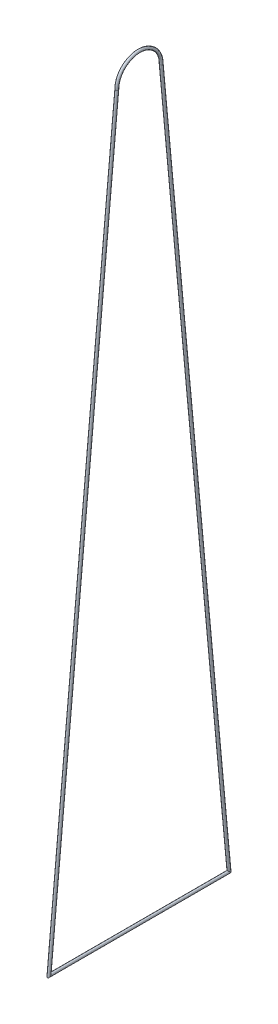
ISO-10303-21;
HEADER;
FILE_DESCRIPTION(('STEP AP214'),'2;1');
FILE_NAME('part.step','',(''),(''),'','','');
FILE_SCHEMA(('AUTOMOTIVE_DESIGN { 1 0 10303 214 1 1 1 1 }'));
ENDSEC;
DATA;
#1=APPLICATION_CONTEXT('core data for automotive mechanical design processes');
#2=APPLICATION_PROTOCOL_DEFINITION('international standard','automotive_design',2000,#1);
#3=PRODUCT_CONTEXT('',#1,'mechanical');
#4=PRODUCT('Part','Part','',(#3));
#5=PRODUCT_RELATED_PRODUCT_CATEGORY('part','',(#4));
#6=PRODUCT_DEFINITION_FORMATION('','',#4);
#7=PRODUCT_DEFINITION_CONTEXT('part definition',#1,'design');
#8=PRODUCT_DEFINITION('design','',#6,#7);
#9=PRODUCT_DEFINITION_SHAPE('','',#8);
#10=(LENGTH_UNIT() NAMED_UNIT(*) SI_UNIT(.MILLI.,.METRE.));
#11=(NAMED_UNIT(*) PLANE_ANGLE_UNIT() SI_UNIT($,.RADIAN.));
#12=(NAMED_UNIT(*) SI_UNIT($,.STERADIAN.) SOLID_ANGLE_UNIT());
#13=UNCERTAINTY_MEASURE_WITH_UNIT(LENGTH_MEASURE(1.E-05),#10,'distance_accuracy_value','');
#14=(GEOMETRIC_REPRESENTATION_CONTEXT(3) GLOBAL_UNCERTAINTY_ASSIGNED_CONTEXT((#13)) GLOBAL_UNIT_ASSIGNED_CONTEXT((#10,
#11,#12)) REPRESENTATION_CONTEXT('',''));
#15=CARTESIAN_POINT('',(0.,0.,0.));
#16=DIRECTION('',(0.,0.,1.));
#17=DIRECTION('',(1.,0.,0.));
#18=AXIS2_PLACEMENT_3D('',#15,#16,#17);
#19=CARTESIAN_POINT('',(-108.,75.4276616612493,-1.7));
#20=CARTESIAN_POINT('',(-108.,22.4525712158631,-6.59836475197597));
#21=CARTESIAN_POINT('',(-107.8,75.4276616612493,-1.7));
#22=CARTESIAN_POINT('',(-107.8,22.4525712158631,-6.59836475197597));
#23=CARTESIAN_POINT('',(-107.8,75.4184347979198,-1.50000000000001));
#24=CARTESIAN_POINT('',(-107.8,22.652571215863,-6.37901849916393));
#25=CARTESIAN_POINT('',(-108.,75.4184347979198,-1.50000000000001));
#26=CARTESIAN_POINT('',(-108.,22.652571215863,-6.37901849916393));
#27=CARTESIAN_POINT('',(-108.2,75.4184347979198,-1.50000000000001));
#28=CARTESIAN_POINT('',(-108.2,22.652571215863,-6.37901849916393));
#29=CARTESIAN_POINT('',(-108.2,75.4276616612493,-1.7));
#30=CARTESIAN_POINT('',(-108.2,22.4525712158631,-6.59836475197597));
#31=CARTESIAN_POINT('',(-108.,75.4276616612493,-1.7));
#32=CARTESIAN_POINT('',(-108.,22.4525712158631,-6.59836475197597));
#33=(BOUNDED_SURFACE() B_SPLINE_SURFACE(3,1,((#19,#20),(#21,#22),(#23,#24),(#25,#26),(#27,#28),
(#29,#30),(#31,#32)),.UNSPECIFIED.,.T.,.F.,.F.) B_SPLINE_SURFACE_WITH_KNOTS((4,3,4),(2,2),(0.,
0.5,1.),(0.,1.),.UNSPECIFIED.) GEOMETRIC_REPRESENTATION_ITEM() RATIONAL_B_SPLINE_SURFACE(((1.,
1.),(0.333333333333333,0.333333333333333),(0.333333333333333,0.333333333333333),(1.,1.),
(0.333333333333333,0.333333333333333),(0.333333333333333,0.333333333333333),(1.,1.))) REPRESENTATION_ITEM('') SURFACE());
#34=CARTESIAN_POINT('',(-108.,75.4276616612493,-1.69999999999997));
#35=CARTESIAN_POINT('',(-108.2,75.4276616612493,-1.70000000000017));
#36=CARTESIAN_POINT('',(-108.2,75.4184347979198,-1.50000000000022));
#37=CARTESIAN_POINT('',(-108.,75.4184347979198,-1.50000000000002));
#38=CARTESIAN_POINT('',(-107.8,75.4184347979198,-1.49999999999981));
#39=CARTESIAN_POINT('',(-107.8,75.4276616612493,-1.69999999999977));
#40=CARTESIAN_POINT('',(-108.,75.4276616612493,-1.69999999999997));
#41=(BOUNDED_CURVE() B_SPLINE_CURVE(3,(#34,#35,#36,#37,#38,#39,#40),.UNSPECIFIED.,.T.,
.F.) B_SPLINE_CURVE_WITH_KNOTS((4,3,4),(0.,0.5,1.),
.UNSPECIFIED.) CURVE() GEOMETRIC_REPRESENTATION_ITEM() RATIONAL_B_SPLINE_CURVE((1.,
0.333333333333333,0.333333333333333,1.,0.333333333333333,0.333333333333333,1.)) REPRESENTATION_ITEM(''));
#42=CARTESIAN_POINT('',(-108.,75.4276616612493,-1.69999999999997));
#43=VERTEX_POINT('',#42);
#44=EDGE_CURVE('E49',#43,#43,#41,.F.);
#45=CARTESIAN_POINT('',(-108.,22.4525712158631,-6.59836475197598));
#46=CARTESIAN_POINT('',(-108.2,22.4525712158631,-6.59836475197598));
#47=CARTESIAN_POINT('',(-108.2,22.652571215863,-6.37901849916393));
#48=CARTESIAN_POINT('',(-108.,22.652571215863,-6.37901849916393));
#49=CARTESIAN_POINT('',(-107.8,22.652571215863,-6.37901849916393));
#50=CARTESIAN_POINT('',(-107.8,22.4525712158631,-6.59836475197598));
#51=CARTESIAN_POINT('',(-108.,22.4525712158631,-6.59836475197598));
#52=(BOUNDED_CURVE() B_SPLINE_CURVE(3,(#45,#46,#47,#48,#49,#50,#51),.UNSPECIFIED.,.T.,
.F.) B_SPLINE_CURVE_WITH_KNOTS((4,3,4),(0.,0.5,1.),
.UNSPECIFIED.) CURVE() GEOMETRIC_REPRESENTATION_ITEM() RATIONAL_B_SPLINE_CURVE((1.,
0.333333333333333,0.333333333333333,1.,0.333333333333333,0.333333333333333,1.)) REPRESENTATION_ITEM(''));
#53=CARTESIAN_POINT('',(-108.,22.4525712158631,-6.59836475197598));
#54=VERTEX_POINT('',#53);
#55=EDGE_CURVE('E45',#54,#54,#52,.T.);
#56=ORIENTED_EDGE('',*,*,#44,.T.);
#57=EDGE_LOOP('',(#56));
#58=FACE_BOUND('',#57,.T.);
#59=ORIENTED_EDGE('',*,*,#55,.T.);
#60=EDGE_LOOP('',(#59));
#61=FACE_BOUND('',#60,.T.);
#62=ADVANCED_FACE('F35',(#58,#61),#33,.T.);
#63=CARTESIAN_POINT('',(-108.,22.4525712158631,-6.59836475197598));
#64=CARTESIAN_POINT('',(-108.,22.4525712158631,6.59836475197578));
#65=CARTESIAN_POINT('',(-108.2,22.4525712158631,-6.59836475197598));
#66=CARTESIAN_POINT('',(-108.2,22.4525712158631,6.59836475197578));
#67=CARTESIAN_POINT('',(-108.2,22.652571215863,-6.37901849916393));
#68=CARTESIAN_POINT('',(-108.2,22.652571215863,6.37901849916374));
#69=CARTESIAN_POINT('',(-108.,22.652571215863,-6.37901849916393));
#70=CARTESIAN_POINT('',(-108.,22.652571215863,6.37901849916374));
#71=CARTESIAN_POINT('',(-107.8,22.652571215863,-6.37901849916393));
#72=CARTESIAN_POINT('',(-107.8,22.652571215863,6.37901849916374));
#73=CARTESIAN_POINT('',(-107.8,22.4525712158631,-6.59836475197598));
#74=CARTESIAN_POINT('',(-107.8,22.4525712158631,6.59836475197578));
#75=CARTESIAN_POINT('',(-108.,22.4525712158631,-6.59836475197598));
#76=CARTESIAN_POINT('',(-108.,22.4525712158631,6.59836475197578));
#77=(BOUNDED_SURFACE() B_SPLINE_SURFACE(3,1,((#63,#64),(#65,#66),(#67,#68),(#69,#70),(#71,#72),
(#73,#74),(#75,#76)),.UNSPECIFIED.,.T.,.F.,.F.) B_SPLINE_SURFACE_WITH_KNOTS((4,3,4),(2,2),(0.,
0.5,1.),(0.,1.),.UNSPECIFIED.) GEOMETRIC_REPRESENTATION_ITEM() RATIONAL_B_SPLINE_SURFACE(((1.,
1.),(0.333333333333333,0.333333333333333),(0.333333333333333,0.333333333333333),(1.,1.),
(0.333333333333333,0.333333333333333),(0.333333333333333,0.333333333333333),(1.,1.))) REPRESENTATION_ITEM('') SURFACE());
#78=CARTESIAN_POINT('',(-108.,22.4525712158631,6.59836475197578));
#79=CARTESIAN_POINT('',(-108.2,22.4525712158631,6.59836475197578));
#80=CARTESIAN_POINT('',(-108.2,22.652571215863,6.37901849916374));
#81=CARTESIAN_POINT('',(-108.,22.652571215863,6.37901849916374));
#82=CARTESIAN_POINT('',(-107.8,22.652571215863,6.37901849916374));
#83=CARTESIAN_POINT('',(-107.8,22.4525712158631,6.59836475197578));
#84=CARTESIAN_POINT('',(-108.,22.4525712158631,6.59836475197578));
#85=(BOUNDED_CURVE() B_SPLINE_CURVE(3,(#78,#79,#80,#81,#82,#83,#84),.UNSPECIFIED.,.T.,
.F.) B_SPLINE_CURVE_WITH_KNOTS((4,3,4),(0.,0.5,1.),
.UNSPECIFIED.) CURVE() GEOMETRIC_REPRESENTATION_ITEM() RATIONAL_B_SPLINE_CURVE((1.,
0.333333333333333,0.333333333333333,1.,0.333333333333333,0.333333333333333,1.)) REPRESENTATION_ITEM(''));
#86=CARTESIAN_POINT('',(-108.,22.4525712158631,6.59836475197578));
#87=VERTEX_POINT('',#86);
#88=EDGE_CURVE('E11',#87,#87,#85,.F.);
#89=ORIENTED_EDGE('',*,*,#55,.F.);
#90=EDGE_LOOP('',(#89));
#91=FACE_BOUND('',#90,.T.);
#92=ORIENTED_EDGE('',*,*,#88,.F.);
#93=EDGE_LOOP('',(#92));
#94=FACE_BOUND('',#93,.T.);
#95=ADVANCED_FACE('F83',(#91,#94),#77,.F.);
#96=CARTESIAN_POINT('',(-108.,22.4525712158631,6.59836475197578));
#97=CARTESIAN_POINT('',(-108.,75.4276616612493,1.69999999999999));
#98=CARTESIAN_POINT('',(-107.8,22.4525712158631,6.59836475197578));
#99=CARTESIAN_POINT('',(-107.8,75.4276616612493,1.69999999999999));
#100=CARTESIAN_POINT('',(-107.8,22.652571215863,6.37901849916374));
#101=CARTESIAN_POINT('',(-107.8,75.4184347979198,1.50000000000003));
#102=CARTESIAN_POINT('',(-108.,22.652571215863,6.37901849916374));
#103=CARTESIAN_POINT('',(-108.,75.4184347979198,1.50000000000003));
#104=CARTESIAN_POINT('',(-108.2,22.652571215863,6.37901849916374));
#105=CARTESIAN_POINT('',(-108.2,75.4184347979198,1.50000000000003));
#106=CARTESIAN_POINT('',(-108.2,22.4525712158631,6.59836475197578));
#107=CARTESIAN_POINT('',(-108.2,75.4276616612493,1.69999999999999));
#108=CARTESIAN_POINT('',(-108.,22.4525712158631,6.59836475197578));
#109=CARTESIAN_POINT('',(-108.,75.4276616612493,1.69999999999999));
#110=(BOUNDED_SURFACE() B_SPLINE_SURFACE(3,1,((#96,#97),(#98,#99),(#100,#101),(#102,#103),(#104,
#105),(#106,#107),(#108,#109)),.UNSPECIFIED.,.T.,.F.,.F.) B_SPLINE_SURFACE_WITH_KNOTS((4,3,4),
(2,2),(0.,0.5,1.),(0.,1.),
.UNSPECIFIED.) GEOMETRIC_REPRESENTATION_ITEM() RATIONAL_B_SPLINE_SURFACE(((1.,1.),
(0.333333333333333,0.333333333333333),(0.333333333333333,0.333333333333333),(1.,1.),
(0.333333333333333,0.333333333333333),(0.333333333333333,0.333333333333333),(1.,1.))) REPRESENTATION_ITEM('') SURFACE());
#111=CARTESIAN_POINT('',(-108.,75.4276616612493,1.69999999999999));
#112=CARTESIAN_POINT('',(-108.2,75.4276616612493,1.69999999999999));
#113=CARTESIAN_POINT('',(-108.2,75.4184347979198,1.50000000000003));
#114=CARTESIAN_POINT('',(-108.,75.4184347979198,1.50000000000003));
#115=CARTESIAN_POINT('',(-107.8,75.4184347979198,1.50000000000003));
#116=CARTESIAN_POINT('',(-107.8,75.4276616612493,1.69999999999999));
#117=CARTESIAN_POINT('',(-108.,75.4276616612493,1.69999999999999));
#118=(BOUNDED_CURVE() B_SPLINE_CURVE(3,(#111,#112,#113,#114,#115,#116,#117),.UNSPECIFIED.,.T.,
.F.) B_SPLINE_CURVE_WITH_KNOTS((4,3,4),(0.,0.5,1.),
.UNSPECIFIED.) CURVE() GEOMETRIC_REPRESENTATION_ITEM() RATIONAL_B_SPLINE_CURVE((1.,
0.333333333333333,0.333333333333333,1.,0.333333333333333,0.333333333333333,1.)) REPRESENTATION_ITEM(''));
#119=CARTESIAN_POINT('',(-108.,75.4276616612493,1.69999999999999));
#120=VERTEX_POINT('',#119);
#121=EDGE_CURVE('E53',#120,#120,#118,.T.);
#122=ORIENTED_EDGE('',*,*,#88,.T.);
#123=EDGE_LOOP('',(#122));
#124=FACE_BOUND('',#123,.T.);
#125=ORIENTED_EDGE('',*,*,#121,.T.);
#126=EDGE_LOOP('',(#125));
#127=FACE_BOUND('',#126,.T.);
#128=ADVANCED_FACE('F74',(#124,#127),#110,.T.);
#129=CARTESIAN_POINT('',(-108.,75.4276616612493,1.69999999999999));
#130=CARTESIAN_POINT('',(-108.,75.4993138640121,1.69999999999999));
#131=CARTESIAN_POINT('',(-108.,75.6613754404232,1.68948330947862));
#132=CARTESIAN_POINT('',(-108.,75.9144334313596,1.63659191961719));
#133=CARTESIAN_POINT('',(-108.,76.1849466575564,1.53062088945838));
#134=CARTESIAN_POINT('',(-108.,76.4388487757896,1.37538067679284));
#135=CARTESIAN_POINT('',(-108.,76.6659746401382,1.16775701586396));
#136=CARTESIAN_POINT('',(-108.,76.8494470950689,0.927414718208074));
#137=CARTESIAN_POINT('',(-108.,76.9981064486479,0.647301798090564));
#138=CARTESIAN_POINT('',(-108.,77.0982731866027,0.334644791745958));
#139=CARTESIAN_POINT('',(-108.,77.1355772023252,1.9491070830049E-13));
#140=CARTESIAN_POINT('',(-108.,77.0982731866028,-0.334644791745968));
#141=CARTESIAN_POINT('',(-108.,76.9981064486479,-0.647301798090489));
#142=CARTESIAN_POINT('',(-108.,76.8494470950689,-0.927414718208006));
#143=CARTESIAN_POINT('',(-108.,76.6659746401381,-1.16775701586391));
#144=CARTESIAN_POINT('',(-108.,76.4388487757896,-1.3753806767928));
#145=CARTESIAN_POINT('',(-108.,76.1849466575564,-1.53062088945832));
#146=CARTESIAN_POINT('',(-108.,75.9144334313597,-1.63659191961717));
#147=CARTESIAN_POINT('',(-108.,75.6613754404233,-1.6894833094786));
#148=CARTESIAN_POINT('',(-108.,75.4993138640121,-1.69999999999997));
#149=CARTESIAN_POINT('',(-108.,75.4276616612493,-1.69999999999997));
#150=CARTESIAN_POINT('',(-108.2,75.4276616612493,1.69999999999999));
#151=CARTESIAN_POINT('',(-108.2,75.4908157342254,1.69999999999999));
#152=CARTESIAN_POINT('',(-108.2,75.6658484158912,1.68948330947862));
#153=CARTESIAN_POINT('',(-108.2,75.9130191122021,1.63659191961722));
#154=CARTESIAN_POINT('',(-108.2,76.1853951416286,1.53062088945833));
#155=CARTESIAN_POINT('',(-108.2,76.4387387902742,1.37538067679287));
#156=CARTESIAN_POINT('',(-108.2,76.6660048286344,1.16775701586397));
#157=CARTESIAN_POINT('',(-108.2,76.8494383570342,0.927414718208125));
#158=CARTESIAN_POINT('',(-108.2,76.9981089180327,0.647301798090545));
#159=CARTESIAN_POINT('',(-108.2,77.098272455041,0.334644791745982));
#160=CARTESIAN_POINT('',(-108.2,77.1355775722829,2.03525455693704E-13));
#161=CARTESIAN_POINT('',(-108.2,77.098272455041,-0.334644791745984));
#162=CARTESIAN_POINT('',(-108.2,76.9981089180327,-0.647301798090494));
#163=CARTESIAN_POINT('',(-108.2,76.8494383570341,-0.927414718207991));
#164=CARTESIAN_POINT('',(-108.2,76.6660048286345,-1.16775701586396));
#165=CARTESIAN_POINT('',(-108.2,76.4387387902741,-1.37538067679274));
#166=CARTESIAN_POINT('',(-108.2,76.1853951416287,-1.53062088945826));
#167=CARTESIAN_POINT('',(-108.2,75.9130191122021,-1.63659191961728));
#168=CARTESIAN_POINT('',(-108.2,75.6658484158913,-1.68948330947879));
#169=CARTESIAN_POINT('',(-108.2,75.4908157342254,-1.70000000000017));
#170=CARTESIAN_POINT('',(-108.2,75.4276616612493,-1.70000000000017));
#171=CARTESIAN_POINT('',(-108.2,75.4184347979198,1.50000000000003));
#172=CARTESIAN_POINT('',(-108.2,75.4815888708959,1.50000000000003));
#173=CARTESIAN_POINT('',(-108.2,75.6389242897183,1.49068825280341));
#174=CARTESIAN_POINT('',(-108.2,75.8555846177867,1.44395952883755));
#175=CARTESIAN_POINT('',(-108.2,76.0945872084601,1.35137567098825));
#176=CARTESIAN_POINT('',(-108.2,76.3205601479912,1.21246252545794));
#177=CARTESIAN_POINT('',(-108.2,76.515997751918,1.03365385121697));
#178=CARTESIAN_POINT('',(-108.2,76.6804928250417,0.818894644849165));
#179=CARTESIAN_POINT('',(-108.2,76.8128811383162,0.569072737598581));
#180=CARTESIAN_POINT('',(-108.2,76.9015444648334,0.291812418257757));
#181=CARTESIAN_POINT('',(-108.2,76.9339228860922,-1.5926084052109E-13));
#182=CARTESIAN_POINT('',(-108.2,76.9015444648334,-0.291812418257556));
#183=CARTESIAN_POINT('',(-108.2,76.8128811383162,-0.569072737598572));
#184=CARTESIAN_POINT('',(-108.2,76.6804928250415,-0.818894644849003));
#185=CARTESIAN_POINT('',(-108.2,76.5159977519181,-1.03365385121698));
#186=CARTESIAN_POINT('',(-108.2,76.3205601479911,-1.21246252545778));
#187=CARTESIAN_POINT('',(-108.2,76.0945872084602,-1.35137567098819));
#188=CARTESIAN_POINT('',(-108.2,75.8555846177867,-1.44395952883761));
#189=CARTESIAN_POINT('',(-108.2,75.6389242897184,-1.49068825280357));
#190=CARTESIAN_POINT('',(-108.2,75.481588870896,-1.50000000000022));
#191=CARTESIAN_POINT('',(-108.2,75.4184347979198,-1.50000000000022));
#192=CARTESIAN_POINT('',(-108.,75.4184347979198,1.50000000000003));
#193=CARTESIAN_POINT('',(-108.,75.4858379357893,1.50000000000003));
#194=CARTESIAN_POINT('',(-108.,75.6366878019844,1.49068825280341));
#195=CARTESIAN_POINT('',(-108.,75.8562917773654,1.44395952883752));
#196=CARTESIAN_POINT('',(-108.,76.094362966424,1.35137567098831));
#197=CARTESIAN_POINT('',(-108.,76.3206151407489,1.2124625254579));
#198=CARTESIAN_POINT('',(-108.,76.5159826576699,1.03365385121697));
#199=CARTESIAN_POINT('',(-108.,76.680497194059,0.81889464484913));
#200=CARTESIAN_POINT('',(-108.,76.8128799036238,0.56907273759858));
#201=CARTESIAN_POINT('',(-108.,76.9015448306143,0.291812418257732));
#202=CARTESIAN_POINT('',(-108.,76.9339227011134,-1.64264714086203E-13));
#203=CARTESIAN_POINT('',(-108.,76.9015448306143,-0.291812418257553));
#204=CARTESIAN_POINT('',(-108.,76.8128799036238,-0.569072737598559));
#205=CARTESIAN_POINT('',(-108.,76.6804971940589,-0.818894644849033));
#206=CARTESIAN_POINT('',(-108.,76.5159826576699,-1.03365385121694));
#207=CARTESIAN_POINT('',(-108.,76.3206151407489,-1.21246252545784));
#208=CARTESIAN_POINT('',(-108.,76.094362966424,-1.35137567098826));
#209=CARTESIAN_POINT('',(-108.,75.8562917773655,-1.44395952883749));
#210=CARTESIAN_POINT('',(-108.,75.6366878019844,-1.49068825280339));
#211=CARTESIAN_POINT('',(-108.,75.4858379357893,-1.50000000000002));
#212=CARTESIAN_POINT('',(-108.,75.4184347979198,-1.50000000000002));
#213=CARTESIAN_POINT('',(-107.8,75.4184347979198,1.50000000000003));
#214=CARTESIAN_POINT('',(-107.8,75.4900870006826,1.50000000000003));
#215=CARTESIAN_POINT('',(-107.8,75.6344513142504,1.49068825280341));
#216=CARTESIAN_POINT('',(-107.8,75.8569989369442,1.4439595288375));
#217=CARTESIAN_POINT('',(-107.8,76.0941387243879,1.35137567098833));
#218=CARTESIAN_POINT('',(-107.8,76.3206701335066,1.21246252545788));
#219=CARTESIAN_POINT('',(-107.8,76.5159675634219,1.033653851217));
#220=CARTESIAN_POINT('',(-107.8,76.6805015630763,0.818894644849061));
#221=CARTESIAN_POINT('',(-107.8,76.8128786689314,0.569072737598597));
#222=CARTESIAN_POINT('',(-107.8,76.9015451963951,0.29181241825774));
#223=CARTESIAN_POINT('',(-107.8,76.9339225161346,-1.68044932980372E-13));
#224=CARTESIAN_POINT('',(-107.8,76.9015451963951,-0.291812418257566));
#225=CARTESIAN_POINT('',(-107.8,76.8128786689314,-0.569072737598526));
#226=CARTESIAN_POINT('',(-107.8,76.6805015630764,-0.818894644849107));
#227=CARTESIAN_POINT('',(-107.8,76.5159675634217,-1.03365385121687));
#228=CARTESIAN_POINT('',(-107.8,76.3206701335067,-1.21246252545789));
#229=CARTESIAN_POINT('',(-107.8,76.0941387243879,-1.35137567098831));
#230=CARTESIAN_POINT('',(-107.8,75.8569989369442,-1.44395952883738));
#231=CARTESIAN_POINT('',(-107.8,75.6344513142504,-1.4906882528032));
#232=CARTESIAN_POINT('',(-107.8,75.4900870006826,-1.49999999999981));
#233=CARTESIAN_POINT('',(-107.8,75.4184347979198,-1.49999999999981));
#234=CARTESIAN_POINT('',(-107.8,75.4276616612493,1.69999999999999));
#235=CARTESIAN_POINT('',(-107.8,75.5078119937988,1.69999999999999));
#236=CARTESIAN_POINT('',(-107.8,75.6569024649553,1.68948330947862));
#237=CARTESIAN_POINT('',(-107.8,75.9158477505171,1.63659191961716));
#238=CARTESIAN_POINT('',(-107.8,76.1844981734841,1.53062088945841));
#239=CARTESIAN_POINT('',(-107.8,76.438958761305,1.3753806767928));
#240=CARTESIAN_POINT('',(-107.8,76.6659444516419,1.16775701586399));
#241=CARTESIAN_POINT('',(-107.8,76.8494558331036,0.92741471820802));
#242=CARTESIAN_POINT('',(-107.8,76.9981039792631,0.647301798090561));
#243=CARTESIAN_POINT('',(-107.8,77.0982739181644,0.334644791745964));
#244=CARTESIAN_POINT('',(-107.8,77.1355768323676,1.94741363234422E-13));
#245=CARTESIAN_POINT('',(-107.8,77.0982739181644,-0.334644791745994));
#246=CARTESIAN_POINT('',(-107.8,76.998103979263,-0.647301798090449));
#247=CARTESIAN_POINT('',(-107.8,76.8494558331037,-0.927414718208095));
#248=CARTESIAN_POINT('',(-107.8,76.6659444516418,-1.16775701586385));
#249=CARTESIAN_POINT('',(-107.8,76.4389587613051,-1.37538067679285));
#250=CARTESIAN_POINT('',(-107.8,76.1844981734841,-1.53062088945838));
#251=CARTESIAN_POINT('',(-107.8,75.9158477505172,-1.63659191961704));
#252=CARTESIAN_POINT('',(-107.8,75.6569024649553,-1.68948330947841));
#253=CARTESIAN_POINT('',(-107.8,75.5078119937988,-1.69999999999977));
#254=CARTESIAN_POINT('',(-107.8,75.4276616612493,-1.69999999999977));
#255=CARTESIAN_POINT('',(-108.,75.4276616612493,1.69999999999999));
#256=CARTESIAN_POINT('',(-108.,75.4993138640121,1.69999999999999));
#257=CARTESIAN_POINT('',(-108.,75.6613754404232,1.68948330947862));
#258=CARTESIAN_POINT('',(-108.,75.9144334313596,1.63659191961719));
#259=CARTESIAN_POINT('',(-108.,76.1849466575564,1.53062088945838));
#260=CARTESIAN_POINT('',(-108.,76.4388487757896,1.37538067679284));
#261=CARTESIAN_POINT('',(-108.,76.6659746401382,1.16775701586396));
#262=CARTESIAN_POINT('',(-108.,76.8494470950689,0.927414718208074));
#263=CARTESIAN_POINT('',(-108.,76.9981064486479,0.647301798090564));
#264=CARTESIAN_POINT('',(-108.,77.0982731866027,0.334644791745958));
#265=CARTESIAN_POINT('',(-108.,77.1355772023252,1.9491070830049E-13));
#266=CARTESIAN_POINT('',(-108.,77.0982731866028,-0.334644791745968));
#267=CARTESIAN_POINT('',(-108.,76.9981064486479,-0.647301798090489));
#268=CARTESIAN_POINT('',(-108.,76.8494470950689,-0.927414718208006));
#269=CARTESIAN_POINT('',(-108.,76.6659746401381,-1.16775701586391));
#270=CARTESIAN_POINT('',(-108.,76.4388487757896,-1.3753806767928));
#271=CARTESIAN_POINT('',(-108.,76.1849466575564,-1.53062088945832));
#272=CARTESIAN_POINT('',(-108.,75.9144334313597,-1.63659191961717));
#273=CARTESIAN_POINT('',(-108.,75.6613754404233,-1.6894833094786));
#274=CARTESIAN_POINT('',(-108.,75.4993138640121,-1.69999999999997));
#275=CARTESIAN_POINT('',(-108.,75.4276616612493,-1.69999999999997));
#276=(BOUNDED_SURFACE() B_SPLINE_SURFACE(3,3,((#129,#130,#131,#132,#133,#134,#135,#136,#137,
#138,#139,#140,#141,#142,#143,#144,#145,#146,#147,#148,#149),(#150,#151,#152,#153,#154,#155,
#156,#157,#158,#159,#160,#161,#162,#163,#164,#165,#166,#167,#168,#169,#170),(#171,#172,#173,
#174,#175,#176,#177,#178,#179,#180,#181,#182,#183,#184,#185,#186,#187,#188,#189,#190,#191),
(#192,#193,#194,#195,#196,#197,#198,#199,#200,#201,#202,#203,#204,#205,#206,#207,#208,#209,#210,
#211,#212),(#213,#214,#215,#216,#217,#218,#219,#220,#221,#222,#223,#224,#225,#226,#227,#228,
#229,#230,#231,#232,#233),(#234,#235,#236,#237,#238,#239,#240,#241,#242,#243,#244,#245,#246,
#247,#248,#249,#250,#251,#252,#253,#254),(#255,#256,#257,#258,#259,#260,#261,#262,#263,#264,
#265,#266,#267,#268,#269,#270,#271,#272,#273,#274,#275)),.UNSPECIFIED.,.T.,.F.,
.F.) B_SPLINE_SURFACE_WITH_KNOTS((4,3,4),(4,1,1,1,1,1,1,1,1,1,1,1,1,1,1,1,1,1,4),(0.,0.5,1.),
(0.,0.0427466368514522,0.0911740627971556,0.145038452560422,0.205133484196707,0.258545158375598,
0.315767193965245,0.375584775953485,0.437082048586603,0.499999999999993,0.562917951413389,
0.624415224046512,0.684232806034754,0.741454841624401,0.794866515803287,0.854961547439565,
0.908825937202832,0.957253363148537,1.),
.UNSPECIFIED.) GEOMETRIC_REPRESENTATION_ITEM() RATIONAL_B_SPLINE_SURFACE(((1.,1.,1.,1.,1.,1.,1.,
1.,1.,1.,1.,1.,1.,1.,1.,1.,1.,1.,1.,1.,1.),(0.333333333333333,0.333333333333333,
0.333333333333333,0.333333333333333,0.333333333333333,0.333333333333333,0.333333333333333,
0.333333333333333,0.333333333333333,0.333333333333333,0.333333333333333,0.333333333333333,
0.333333333333333,0.333333333333333,0.333333333333333,0.333333333333333,0.333333333333334,
0.333333333333333,0.333333333333333,0.333333333333333,0.333333333333333),(0.333333333333333,
0.333333333333333,0.333333333333333,0.333333333333333,0.333333333333333,0.333333333333333,
0.333333333333333,0.333333333333333,0.333333333333333,0.333333333333333,0.333333333333333,
0.333333333333333,0.333333333333333,0.333333333333333,0.333333333333333,0.333333333333333,
0.333333333333334,0.333333333333333,0.333333333333333,0.333333333333333,0.333333333333333),(1.,
1.,1.,1.,1.,1.,1.,1.,1.,1.,1.,1.,1.,1.,1.,1.,1.,1.,1.,1.,1.),(0.333333333333333,
0.333333333333333,0.333333333333333,0.333333333333333,0.333333333333333,0.333333333333333,
0.333333333333333,0.333333333333333,0.333333333333333,0.333333333333333,0.333333333333333,
0.333333333333333,0.333333333333333,0.333333333333333,0.333333333333333,0.333333333333333,
0.333333333333334,0.333333333333333,0.333333333333333,0.333333333333333,0.333333333333333),
(0.333333333333333,0.333333333333333,0.333333333333333,0.333333333333333,0.333333333333333,
0.333333333333333,0.333333333333333,0.333333333333333,0.333333333333333,0.333333333333333,
0.333333333333333,0.333333333333333,0.333333333333333,0.333333333333333,0.333333333333333,
0.333333333333333,0.333333333333334,0.333333333333333,0.333333333333333,0.333333333333333,
0.333333333333333),(1.,1.,1.,1.,1.,1.,1.,1.,1.,1.,1.,1.,1.,1.,1.,1.,1.,1.,1.,1.,1.))) REPRESENTATION_ITEM('') SURFACE());
#277=ORIENTED_EDGE('',*,*,#121,.F.);
#278=EDGE_LOOP('',(#277));
#279=FACE_BOUND('',#278,.T.);
#280=ORIENTED_EDGE('',*,*,#44,.F.);
#281=EDGE_LOOP('',(#280));
#282=FACE_BOUND('',#281,.T.);
#283=ADVANCED_FACE('F76',(#279,#282),#276,.F.);
#284=CLOSED_SHELL('',(#62,#95,#128,#283));
#285=MANIFOLD_SOLID_BREP('B2',#284);
#286=ADVANCED_BREP_SHAPE_REPRESENTATION('',(#18,#285),#14);
#287=SHAPE_DEFINITION_REPRESENTATION(#9,#286);
ENDSEC;
END-ISO-10303-21;
